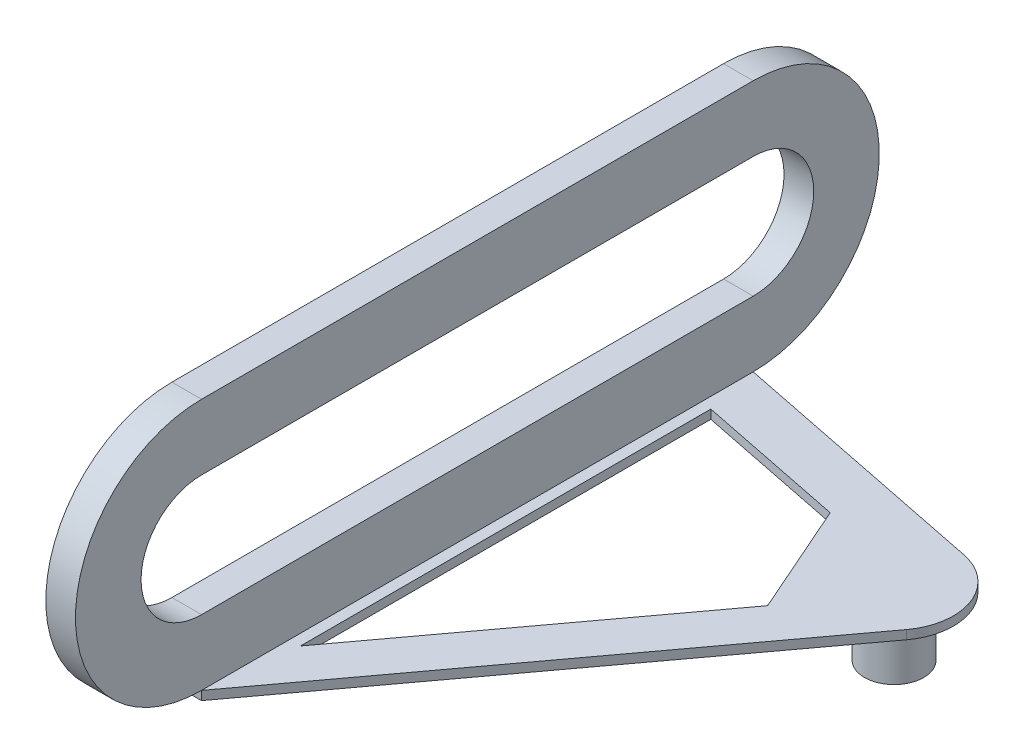
ISO-10303-21;
HEADER;
FILE_DESCRIPTION(('STEP AP214'),'2;1');
FILE_NAME('part.step','',(''),(''),'','','');
FILE_SCHEMA(('AUTOMOTIVE_DESIGN { 1 0 10303 214 1 1 1 1 }'));
ENDSEC;
DATA;
#1=APPLICATION_CONTEXT('core data for automotive mechanical design processes');
#2=APPLICATION_PROTOCOL_DEFINITION('international standard','automotive_design',2000,#1);
#3=PRODUCT_CONTEXT('',#1,'mechanical');
#4=PRODUCT('Part','Part','',(#3));
#5=PRODUCT_RELATED_PRODUCT_CATEGORY('part','',(#4));
#6=PRODUCT_DEFINITION_FORMATION('','',#4);
#7=PRODUCT_DEFINITION_CONTEXT('part definition',#1,'design');
#8=PRODUCT_DEFINITION('design','',#6,#7);
#9=PRODUCT_DEFINITION_SHAPE('','',#8);
#10=(LENGTH_UNIT() NAMED_UNIT(*) SI_UNIT(.MILLI.,.METRE.));
#11=(NAMED_UNIT(*) PLANE_ANGLE_UNIT() SI_UNIT($,.RADIAN.));
#12=(NAMED_UNIT(*) SI_UNIT($,.STERADIAN.) SOLID_ANGLE_UNIT());
#13=UNCERTAINTY_MEASURE_WITH_UNIT(LENGTH_MEASURE(1.E-05),#10,'distance_accuracy_value','');
#14=(GEOMETRIC_REPRESENTATION_CONTEXT(3) GLOBAL_UNCERTAINTY_ASSIGNED_CONTEXT((#13)) GLOBAL_UNIT_ASSIGNED_CONTEXT((#10,
#11,#12)) REPRESENTATION_CONTEXT('',''));
#15=CARTESIAN_POINT('',(0.,0.,0.));
#16=DIRECTION('',(0.,0.,1.));
#17=DIRECTION('',(1.,0.,0.));
#18=AXIS2_PLACEMENT_3D('',#15,#16,#17);
#19=CARTESIAN_POINT('',(0.,0.,0.));
#20=DIRECTION('',(1.,0.,0.));
#21=DIRECTION('',(0.,0.,-1.));
#22=AXIS2_PLACEMENT_3D('',#19,#20,#21);
#23=CYLINDRICAL_SURFACE('',#22,42.5);
#24=CARTESIAN_POINT('',(10.,0.,0.));
#25=DIRECTION('',(1.,0.,0.));
#26=DIRECTION('',(0.,0.,-1.));
#27=AXIS2_PLACEMENT_3D('',#24,#25,#26);
#28=CIRCLE('',#27,42.5);
#29=CARTESIAN_POINT('',(10.,-42.5,0.));
#30=VERTEX_POINT('',#29);
#31=CARTESIAN_POINT('',(10.,42.5,0.));
#32=VERTEX_POINT('',#31);
#33=EDGE_CURVE('E251',#30,#32,#28,.T.);
#34=ORIENTED_EDGE('',*,*,#33,.F.);
#35=DIRECTION('',(1.,0.,0.));
#36=VECTOR('',#35,1.);
#37=CARTESIAN_POINT('',(0.,-42.5,0.));
#38=LINE('',#37,#36);
#39=CARTESIAN_POINT('',(0.,-42.5,0.));
#40=VERTEX_POINT('',#39);
#41=EDGE_CURVE('E273',#40,#30,#38,.T.);
#42=ORIENTED_EDGE('',*,*,#41,.F.);
#43=CARTESIAN_POINT('',(0.,0.,0.));
#44=DIRECTION('',(1.,0.,0.));
#45=DIRECTION('',(0.,0.,-1.));
#46=AXIS2_PLACEMENT_3D('',#43,#44,#45);
#47=CIRCLE('',#46,42.5);
#48=CARTESIAN_POINT('',(0.,42.5,0.));
#49=VERTEX_POINT('',#48);
#50=EDGE_CURVE('E252',#40,#49,#47,.T.);
#51=ORIENTED_EDGE('',*,*,#50,.T.);
#52=DIRECTION('',(1.,0.,0.));
#53=VECTOR('',#52,1.);
#54=CARTESIAN_POINT('',(0.,42.5,0.));
#55=LINE('',#54,#53);
#56=EDGE_CURVE('E262',#49,#32,#55,.T.);
#57=ORIENTED_EDGE('',*,*,#56,.T.);
#58=EDGE_LOOP('',(#34,#42,#51,#57));
#59=FACE_BOUND('',#58,.T.);
#60=ADVANCED_FACE('F39',(#59),#23,.T.);
#61=CARTESIAN_POINT('',(0.,0.,186.));
#62=DIRECTION('',(1.,0.,0.));
#63=DIRECTION('',(0.,0.,-1.));
#64=AXIS2_PLACEMENT_3D('',#61,#62,#63);
#65=CYLINDRICAL_SURFACE('',#64,42.5);
#66=CARTESIAN_POINT('',(10.,0.,186.));
#67=DIRECTION('',(1.,0.,0.));
#68=DIRECTION('',(0.,0.,-1.));
#69=AXIS2_PLACEMENT_3D('',#66,#67,#68);
#70=CIRCLE('',#69,42.5);
#71=CARTESIAN_POINT('',(10.,42.5,186.));
#72=VERTEX_POINT('',#71);
#73=CARTESIAN_POINT('',(10.,-42.5,186.));
#74=VERTEX_POINT('',#73);
#75=EDGE_CURVE('E268',#72,#74,#70,.T.);
#76=ORIENTED_EDGE('',*,*,#75,.F.);
#77=DIRECTION('',(1.,0.,0.));
#78=VECTOR('',#77,1.);
#79=CARTESIAN_POINT('',(0.,42.5,186.));
#80=LINE('',#79,#78);
#81=CARTESIAN_POINT('',(0.,42.5,186.));
#82=VERTEX_POINT('',#81);
#83=EDGE_CURVE('E280',#82,#72,#80,.T.);
#84=ORIENTED_EDGE('',*,*,#83,.F.);
#85=CARTESIAN_POINT('',(0.,0.,186.));
#86=DIRECTION('',(1.,0.,0.));
#87=DIRECTION('',(0.,0.,-1.));
#88=AXIS2_PLACEMENT_3D('',#85,#86,#87);
#89=CIRCLE('',#88,42.5);
#90=CARTESIAN_POINT('',(0.,-42.5,186.));
#91=VERTEX_POINT('',#90);
#92=EDGE_CURVE('E259',#82,#91,#89,.T.);
#93=ORIENTED_EDGE('',*,*,#92,.T.);
#94=DIRECTION('',(1.,0.,0.));
#95=VECTOR('',#94,1.);
#96=CARTESIAN_POINT('',(0.,-42.5,186.));
#97=LINE('',#96,#95);
#98=EDGE_CURVE('E277',#91,#74,#97,.T.);
#99=ORIENTED_EDGE('',*,*,#98,.T.);
#100=EDGE_LOOP('',(#76,#84,#93,#99));
#101=FACE_BOUND('',#100,.T.);
#102=ADVANCED_FACE('F310',(#101),#65,.T.);
#103=CARTESIAN_POINT('',(0.,42.5,0.));
#104=DIRECTION('',(0.,1.,0.));
#105=DIRECTION('',(0.,0.,1.));
#106=AXIS2_PLACEMENT_3D('',#103,#104,#105);
#107=PLANE('',#106);
#108=DIRECTION('',(0.,0.,1.));
#109=VECTOR('',#108,1.);
#110=CARTESIAN_POINT('',(10.,42.5,0.));
#111=LINE('',#110,#109);
#112=EDGE_CURVE('E265',#32,#72,#111,.T.);
#113=ORIENTED_EDGE('',*,*,#112,.F.);
#114=ORIENTED_EDGE('',*,*,#56,.F.);
#115=DIRECTION('',(0.,0.,1.));
#116=VECTOR('',#115,1.);
#117=CARTESIAN_POINT('',(0.,42.5,0.));
#118=LINE('',#117,#116);
#119=EDGE_CURVE('E255',#49,#82,#118,.T.);
#120=ORIENTED_EDGE('',*,*,#119,.T.);
#121=ORIENTED_EDGE('',*,*,#83,.T.);
#122=EDGE_LOOP('',(#113,#114,#120,#121));
#123=FACE_BOUND('',#122,.T.);
#124=ADVANCED_FACE('F315',(#123),#107,.T.);
#125=CARTESIAN_POINT('',(0.,0.,0.));
#126=DIRECTION('',(1.,0.,0.));
#127=DIRECTION('',(0.,0.,-1.));
#128=AXIS2_PLACEMENT_3D('',#125,#126,#127);
#129=PLANE('',#128);
#130=DIRECTION('',(0.,0.,1.));
#131=VECTOR('',#130,1.);
#132=CARTESIAN_POINT('',(0.,20.3900026725424,0.));
#133=LINE('',#132,#131);
#134=CARTESIAN_POINT('',(0.,20.3900026725424,0.));
#135=VERTEX_POINT('',#134);
#136=CARTESIAN_POINT('',(0.,20.3900026725424,186.));
#137=VERTEX_POINT('',#136);
#138=EDGE_CURVE('E189',#135,#137,#133,.T.);
#139=ORIENTED_EDGE('',*,*,#138,.T.);
#140=CARTESIAN_POINT('',(0.,0.,186.));
#141=DIRECTION('',(1.,0.,0.));
#142=DIRECTION('',(0.,0.,-1.));
#143=AXIS2_PLACEMENT_3D('',#140,#141,#142);
#144=CIRCLE('',#143,20.3900026725424);
#145=CARTESIAN_POINT('',(0.,-20.3900026725424,186.));
#146=VERTEX_POINT('',#145);
#147=EDGE_CURVE('E179',#137,#146,#144,.T.);
#148=ORIENTED_EDGE('',*,*,#147,.T.);
#149=DIRECTION('',(0.,0.,-1.));
#150=VECTOR('',#149,1.);
#151=CARTESIAN_POINT('',(0.,-20.3900026725424,186.));
#152=LINE('',#151,#150);
#153=CARTESIAN_POINT('',(0.,-20.3900026725424,0.));
#154=VERTEX_POINT('',#153);
#155=EDGE_CURVE('E182',#146,#154,#152,.T.);
#156=ORIENTED_EDGE('',*,*,#155,.T.);
#157=CARTESIAN_POINT('',(0.,0.,0.));
#158=DIRECTION('',(1.,0.,0.));
#159=DIRECTION('',(0.,0.,-1.));
#160=AXIS2_PLACEMENT_3D('',#157,#158,#159);
#161=CIRCLE('',#160,20.3900026725424);
#162=EDGE_CURVE('E186',#154,#135,#161,.T.);
#163=ORIENTED_EDGE('',*,*,#162,.T.);
#164=EDGE_LOOP('',(#139,#148,#156,#163));
#165=FACE_BOUND('',#164,.T.);
#166=ORIENTED_EDGE('',*,*,#50,.F.);
#167=DIRECTION('',(0.,1.,0.));
#168=VECTOR('',#167,1.);
#169=CARTESIAN_POINT('',(0.,-45.5,0.));
#170=LINE('',#169,#168);
#171=CARTESIAN_POINT('',(0.,-45.5,0.));
#172=VERTEX_POINT('',#171);
#173=EDGE_CURVE('E240',#172,#40,#170,.T.);
#174=ORIENTED_EDGE('',*,*,#173,.F.);
#175=DIRECTION('',(0.,0.,-1.));
#176=VECTOR('',#175,1.);
#177=CARTESIAN_POINT('',(0.,-45.5,0.));
#178=LINE('',#177,#176);
#179=CARTESIAN_POINT('',(0.,-45.5,186.));
#180=VERTEX_POINT('',#179);
#181=EDGE_CURVE('E222',#180,#172,#178,.T.);
#182=ORIENTED_EDGE('',*,*,#181,.F.);
#183=DIRECTION('',(0.,1.,0.));
#184=VECTOR('',#183,1.);
#185=CARTESIAN_POINT('',(0.,-45.5,186.));
#186=LINE('',#185,#184);
#187=EDGE_CURVE('E242',#180,#91,#186,.T.);
#188=ORIENTED_EDGE('',*,*,#187,.T.);
#189=ORIENTED_EDGE('',*,*,#92,.F.);
#190=ORIENTED_EDGE('',*,*,#119,.F.);
#191=EDGE_LOOP('',(#166,#174,#182,#188,#189,#190));
#192=FACE_BOUND('',#191,.T.);
#193=ADVANCED_FACE('F337',(#165,#192),#129,.F.);
#194=CARTESIAN_POINT('',(10.,0.,0.));
#195=DIRECTION('',(1.,0.,0.));
#196=DIRECTION('',(0.,0.,-1.));
#197=AXIS2_PLACEMENT_3D('',#194,#195,#196);
#198=PLANE('',#197);
#199=CARTESIAN_POINT('',(10.,0.,186.));
#200=DIRECTION('',(1.,0.,0.));
#201=DIRECTION('',(0.,0.,-1.));
#202=AXIS2_PLACEMENT_3D('',#199,#200,#201);
#203=CIRCLE('',#202,20.3900026725424);
#204=CARTESIAN_POINT('',(10.,20.3900026725424,186.));
#205=VERTEX_POINT('',#204);
#206=CARTESIAN_POINT('',(10.,-20.3900026725424,186.));
#207=VERTEX_POINT('',#206);
#208=EDGE_CURVE('E176',#205,#207,#203,.T.);
#209=ORIENTED_EDGE('',*,*,#208,.F.);
#210=DIRECTION('',(0.,0.,1.));
#211=VECTOR('',#210,1.);
#212=CARTESIAN_POINT('',(10.,20.3900026725424,0.));
#213=LINE('',#212,#211);
#214=CARTESIAN_POINT('',(10.,20.3900026725424,0.));
#215=VERTEX_POINT('',#214);
#216=EDGE_CURVE('E183',#215,#205,#213,.T.);
#217=ORIENTED_EDGE('',*,*,#216,.F.);
#218=CARTESIAN_POINT('',(10.,0.,0.));
#219=DIRECTION('',(1.,0.,0.));
#220=DIRECTION('',(0.,0.,-1.));
#221=AXIS2_PLACEMENT_3D('',#218,#219,#220);
#222=CIRCLE('',#221,20.3900026725424);
#223=CARTESIAN_POINT('',(10.,-20.3900026725424,0.));
#224=VERTEX_POINT('',#223);
#225=EDGE_CURVE('E197',#224,#215,#222,.T.);
#226=ORIENTED_EDGE('',*,*,#225,.F.);
#227=DIRECTION('',(0.,0.,-1.));
#228=VECTOR('',#227,1.);
#229=CARTESIAN_POINT('',(10.,-20.3900026725424,186.));
#230=LINE('',#229,#228);
#231=EDGE_CURVE('E194',#207,#224,#230,.T.);
#232=ORIENTED_EDGE('',*,*,#231,.F.);
#233=EDGE_LOOP('',(#209,#217,#226,#232));
#234=FACE_BOUND('',#233,.T.);
#235=ORIENTED_EDGE('',*,*,#33,.T.);
#236=ORIENTED_EDGE('',*,*,#112,.T.);
#237=ORIENTED_EDGE('',*,*,#75,.T.);
#238=DIRECTION('',(0.,0.,-1.));
#239=VECTOR('',#238,1.);
#240=CARTESIAN_POINT('',(10.,-42.5,186.));
#241=LINE('',#240,#239);
#242=EDGE_CURVE('E256',#74,#30,#241,.T.);
#243=ORIENTED_EDGE('',*,*,#242,.T.);
#244=EDGE_LOOP('',(#235,#236,#237,#243));
#245=FACE_BOUND('',#244,.T.);
#246=ADVANCED_FACE('F323',(#234,#245),#198,.T.);
#247=CARTESIAN_POINT('',(95.,-45.5,37.5));
#248=DIRECTION('',(0.,1.,0.));
#249=DIRECTION('',(0.,0.,1.));
#250=AXIS2_PLACEMENT_3D('',#247,#248,#249);
#251=CYLINDRICAL_SURFACE('',#250,20.);
#252=CARTESIAN_POINT('',(95.,-42.5,37.5));
#253=DIRECTION('',(0.,-1.,0.));
#254=DIRECTION('',(0.,0.,1.));
#255=AXIS2_PLACEMENT_3D('',#252,#253,#254);
#256=CIRCLE('',#255,20.);
#257=CARTESIAN_POINT('',(98.9443507508866,-42.5,17.892804964657));
#258=VERTEX_POINT('',#257);
#259=CARTESIAN_POINT('',(111.077371779587,-42.5,49.3961387290563));
#260=VERTEX_POINT('',#259);
#261=EDGE_CURVE('E213',#258,#260,#256,.T.);
#262=ORIENTED_EDGE('',*,*,#261,.T.);
#263=DIRECTION('',(0.,1.,0.));
#264=VECTOR('',#263,1.);
#265=CARTESIAN_POINT('',(111.077371779587,-45.5,49.3961387290563));
#266=LINE('',#265,#264);
#267=CARTESIAN_POINT('',(111.077371779587,-45.5,49.3961387290563));
#268=VERTEX_POINT('',#267);
#269=EDGE_CURVE('E248',#268,#260,#266,.T.);
#270=ORIENTED_EDGE('',*,*,#269,.F.);
#271=CARTESIAN_POINT('',(95.,-45.5,37.5));
#272=DIRECTION('',(0.,-1.,0.));
#273=DIRECTION('',(0.,0.,1.));
#274=AXIS2_PLACEMENT_3D('',#271,#272,#273);
#275=CIRCLE('',#274,20.);
#276=CARTESIAN_POINT('',(98.9443507508866,-45.5,17.892804964657));
#277=VERTEX_POINT('',#276);
#278=EDGE_CURVE('E214',#277,#268,#275,.T.);
#279=ORIENTED_EDGE('',*,*,#278,.F.);
#280=DIRECTION('',(0.,1.,0.));
#281=VECTOR('',#280,1.);
#282=CARTESIAN_POINT('',(98.9443507508866,-45.5,17.892804964657));
#283=LINE('',#282,#281);
#284=EDGE_CURVE('E228',#277,#258,#283,.T.);
#285=ORIENTED_EDGE('',*,*,#284,.T.);
#286=EDGE_LOOP('',(#262,#270,#279,#285));
#287=FACE_BOUND('',#286,.T.);
#288=ADVANCED_FACE('F348',(#287),#251,.T.);
#289=CARTESIAN_POINT('',(10.,-45.5,186.));
#290=DIRECTION('',(-0.803868588979329,0.,-0.594806936452815));
#291=DIRECTION('',(-0.594806936452815,0.,0.803868588979329));
#292=AXIS2_PLACEMENT_3D('',#289,#290,#291);
#293=PLANE('',#292);
#294=DIRECTION('',(-0.594806936452815,0.,0.803868588979329));
#295=VECTOR('',#294,1.);
#296=CARTESIAN_POINT('',(10.,-42.5,186.));
#297=LINE('',#296,#295);
#298=EDGE_CURVE('E231',#260,#74,#297,.T.);
#299=ORIENTED_EDGE('',*,*,#298,.T.);
#300=DIRECTION('',(0.,1.,0.));
#301=VECTOR('',#300,1.);
#302=CARTESIAN_POINT('',(10.,-45.5,186.));
#303=LINE('',#302,#301);
#304=CARTESIAN_POINT('',(10.,-45.5,186.));
#305=VERTEX_POINT('',#304);
#306=EDGE_CURVE('E245',#305,#74,#303,.T.);
#307=ORIENTED_EDGE('',*,*,#306,.F.);
#308=DIRECTION('',(-0.594806936452815,0.,0.803868588979329));
#309=VECTOR('',#308,1.);
#310=CARTESIAN_POINT('',(10.,-45.5,186.));
#311=LINE('',#310,#309);
#312=EDGE_CURVE('E217',#268,#305,#311,.T.);
#313=ORIENTED_EDGE('',*,*,#312,.F.);
#314=ORIENTED_EDGE('',*,*,#269,.T.);
#315=EDGE_LOOP('',(#299,#307,#313,#314));
#316=FACE_BOUND('',#315,.T.);
#317=ADVANCED_FACE('F328',(#316),#293,.F.);
#318=CARTESIAN_POINT('',(0.,-45.5,186.));
#319=DIRECTION('',(0.,0.,-1.));
#320=DIRECTION('',(-1.,0.,0.));
#321=AXIS2_PLACEMENT_3D('',#318,#319,#320);
#322=PLANE('',#321);
#323=ORIENTED_EDGE('',*,*,#98,.F.);
#324=ORIENTED_EDGE('',*,*,#187,.F.);
#325=DIRECTION('',(-1.,0.,0.));
#326=VECTOR('',#325,1.);
#327=CARTESIAN_POINT('',(0.,-45.5,186.));
#328=LINE('',#327,#326);
#329=EDGE_CURVE('E220',#305,#180,#328,.T.);
#330=ORIENTED_EDGE('',*,*,#329,.F.);
#331=ORIENTED_EDGE('',*,*,#306,.T.);
#332=EDGE_LOOP('',(#323,#324,#330,#331));
#333=FACE_BOUND('',#332,.T.);
#334=ADVANCED_FACE('F332',(#333),#322,.F.);
#335=CARTESIAN_POINT('',(10.,-45.5,0.));
#336=DIRECTION('',(0.,0.,1.));
#337=DIRECTION('',(1.,0.,0.));
#338=AXIS2_PLACEMENT_3D('',#335,#336,#337);
#339=PLANE('',#338);
#340=ORIENTED_EDGE('',*,*,#41,.T.);
#341=DIRECTION('',(0.,1.,0.));
#342=VECTOR('',#341,1.);
#343=CARTESIAN_POINT('',(10.,-45.5,0.));
#344=LINE('',#343,#342);
#345=CARTESIAN_POINT('',(10.,-45.5,0.));
#346=VERTEX_POINT('',#345);
#347=EDGE_CURVE('E237',#346,#30,#344,.T.);
#348=ORIENTED_EDGE('',*,*,#347,.F.);
#349=DIRECTION('',(1.,0.,0.));
#350=VECTOR('',#349,1.);
#351=CARTESIAN_POINT('',(10.,-45.5,0.));
#352=LINE('',#351,#350);
#353=EDGE_CURVE('E224',#172,#346,#352,.T.);
#354=ORIENTED_EDGE('',*,*,#353,.F.);
#355=ORIENTED_EDGE('',*,*,#173,.T.);
#356=EDGE_LOOP('',(#340,#348,#354,#355));
#357=FACE_BOUND('',#356,.T.);
#358=ADVANCED_FACE('F358',(#357),#339,.F.);
#359=CARTESIAN_POINT('',(98.9443507508866,-45.5,17.892804964657));
#360=DIRECTION('',(-0.197217537544331,0.,0.980359751767151));
#361=DIRECTION('',(0.980359751767151,0.,0.197217537544331));
#362=AXIS2_PLACEMENT_3D('',#359,#360,#361);
#363=PLANE('',#362);
#364=DIRECTION('',(0.980359751767151,0.,0.197217537544331));
#365=VECTOR('',#364,1.);
#366=CARTESIAN_POINT('',(98.9443507508866,-42.5,17.892804964657));
#367=LINE('',#366,#365);
#368=EDGE_CURVE('E218',#30,#258,#367,.T.);
#369=ORIENTED_EDGE('',*,*,#368,.T.);
#370=ORIENTED_EDGE('',*,*,#284,.F.);
#371=DIRECTION('',(0.980359751767151,0.,0.197217537544331));
#372=VECTOR('',#371,1.);
#373=CARTESIAN_POINT('',(98.9443507508866,-45.5,17.892804964657));
#374=LINE('',#373,#372);
#375=EDGE_CURVE('E226',#346,#277,#374,.T.);
#376=ORIENTED_EDGE('',*,*,#375,.F.);
#377=ORIENTED_EDGE('',*,*,#347,.T.);
#378=EDGE_LOOP('',(#369,#370,#376,#377));
#379=FACE_BOUND('',#378,.T.);
#380=ADVANCED_FACE('F361',(#379),#363,.F.);
#381=CARTESIAN_POINT('',(95.,-45.5,37.5));
#382=DIRECTION('',(0.,1.,0.));
#383=DIRECTION('',(0.,0.,1.));
#384=AXIS2_PLACEMENT_3D('',#381,#382,#383);
#385=PLANE('',#384);
#386=DIRECTION('',(0.,0.,-1.));
#387=VECTOR('',#386,1.);
#388=CARTESIAN_POINT('',(13.7159350256524,-45.5,156.359237722558));
#389=LINE('',#388,#387);
#390=CARTESIAN_POINT('',(13.7159350256524,-45.5,156.359237722558));
#391=VERTEX_POINT('',#390);
#392=CARTESIAN_POINT('',(13.7159350256524,-45.5,18.0160142694245));
#393=VERTEX_POINT('',#392);
#394=EDGE_CURVE('E162',#391,#393,#389,.T.);
#395=ORIENTED_EDGE('',*,*,#394,.F.);
#396=DIRECTION('',(-0.594806936452815,0.,0.803868588979329));
#397=VECTOR('',#396,1.);
#398=CARTESIAN_POINT('',(80.693023557422,-45.5,65.8411647944554));
#399=LINE('',#398,#397);
#400=CARTESIAN_POINT('',(80.693023557422,-45.5,65.8411647944554));
#401=VERTEX_POINT('',#400);
#402=EDGE_CURVE('E53',#401,#391,#399,.T.);
#403=ORIENTED_EDGE('',*,*,#402,.F.);
#404=DIRECTION('',(0.402880786195544,0.,0.915252463593767));
#405=VECTOR('',#404,1.);
#406=CARTESIAN_POINT('',(64.1029317293349,-45.5,28.1522927082754));
#407=LINE('',#406,#405);
#408=CARTESIAN_POINT('',(64.1029317293349,-45.5,28.1522927082754));
#409=VERTEX_POINT('',#408);
#410=EDGE_CURVE('E169',#409,#401,#407,.T.);
#411=ORIENTED_EDGE('',*,*,#410,.F.);
#412=DIRECTION('',(0.980359751767151,0.,0.197217537544331));
#413=VECTOR('',#412,1.);
#414=CARTESIAN_POINT('',(13.7159350256524,-45.5,18.0160142694245));
#415=LINE('',#414,#413);
#416=EDGE_CURVE('E153',#393,#409,#415,.T.);
#417=ORIENTED_EDGE('',*,*,#416,.F.);
#418=EDGE_LOOP('',(#395,#403,#411,#417));
#419=FACE_BOUND('',#418,.T.);
#420=CARTESIAN_POINT('',(95.,-45.5,37.5));
#421=DIRECTION('',(0.,1.,0.));
#422=DIRECTION('',(0.,0.,1.));
#423=AXIS2_PLACEMENT_3D('',#420,#421,#422);
#424=CIRCLE('',#423,9.99999999999999);
#425=CARTESIAN_POINT('',(95.,-45.5,47.5));
#426=VERTEX_POINT('',#425);
#427=EDGE_CURVE('E276',#426,#426,#424,.F.);
#428=ORIENTED_EDGE('',*,*,#427,.F.);
#429=EDGE_LOOP('',(#428));
#430=FACE_BOUND('',#429,.T.);
#431=ORIENTED_EDGE('',*,*,#278,.T.);
#432=ORIENTED_EDGE('',*,*,#312,.T.);
#433=ORIENTED_EDGE('',*,*,#329,.T.);
#434=ORIENTED_EDGE('',*,*,#181,.T.);
#435=ORIENTED_EDGE('',*,*,#353,.T.);
#436=ORIENTED_EDGE('',*,*,#375,.T.);
#437=EDGE_LOOP('',(#431,#432,#433,#434,#435,#436));
#438=FACE_BOUND('',#437,.T.);
#439=ADVANCED_FACE('F166',(#419,#430,#438),#385,.F.);
#440=CARTESIAN_POINT('',(95.,-42.5,37.5));
#441=DIRECTION('',(0.,1.,0.));
#442=DIRECTION('',(0.,0.,1.));
#443=AXIS2_PLACEMENT_3D('',#440,#441,#442);
#444=PLANE('',#443);
#445=DIRECTION('',(0.594806936452815,0.,-0.803868588979329));
#446=VECTOR('',#445,1.);
#447=CARTESIAN_POINT('',(99.3059964076367,-42.5,40.6861383399184));
#448=LINE('',#447,#446);
#449=CARTESIAN_POINT('',(13.7159350256524,-42.5,156.359237722558));
#450=VERTEX_POINT('',#449);
#451=CARTESIAN_POINT('',(80.693023557422,-42.5,65.8411647944554));
#452=VERTEX_POINT('',#451);
#453=EDGE_CURVE('E11',#450,#452,#448,.T.);
#454=ORIENTED_EDGE('',*,*,#453,.F.);
#455=DIRECTION('',(0.,0.,1.));
#456=VECTOR('',#455,1.);
#457=CARTESIAN_POINT('',(13.7159350256524,-42.5,37.5));
#458=LINE('',#457,#456);
#459=CARTESIAN_POINT('',(13.7159350256524,-42.5,18.0160142694245));
#460=VERTEX_POINT('',#459);
#461=EDGE_CURVE('E285',#460,#450,#458,.T.);
#462=ORIENTED_EDGE('',*,*,#461,.F.);
#463=DIRECTION('',(-0.980359751767151,0.,-0.197217537544331));
#464=VECTOR('',#463,1.);
#465=CARTESIAN_POINT('',(95.6055904253571,-42.5,34.4896364873626));
#466=LINE('',#465,#464);
#467=CARTESIAN_POINT('',(64.1029317293349,-42.5,28.1522927082754));
#468=VERTEX_POINT('',#467);
#469=EDGE_CURVE('E156',#468,#460,#466,.T.);
#470=ORIENTED_EDGE('',*,*,#469,.F.);
#471=DIRECTION('',(-0.402880786195544,0.,-0.915252463593767));
#472=VECTOR('',#471,1.);
#473=CARTESIAN_POINT('',(72.564776795741,-42.5,47.3756580534223));
#474=LINE('',#473,#472);
#475=EDGE_CURVE('E46',#452,#468,#474,.T.);
#476=ORIENTED_EDGE('',*,*,#475,.F.);
#477=EDGE_LOOP('',(#454,#462,#470,#476));
#478=FACE_BOUND('',#477,.T.);
#479=ORIENTED_EDGE('',*,*,#368,.F.);
#480=ORIENTED_EDGE('',*,*,#242,.F.);
#481=ORIENTED_EDGE('',*,*,#298,.F.);
#482=ORIENTED_EDGE('',*,*,#261,.F.);
#483=EDGE_LOOP('',(#479,#480,#481,#482));
#484=FACE_BOUND('',#483,.T.);
#485=ADVANCED_FACE('F293',(#478,#484),#444,.T.);
#486=CARTESIAN_POINT('',(95.,-65.5,37.5));
#487=DIRECTION('',(0.,1.,0.));
#488=DIRECTION('',(0.,0.,1.));
#489=AXIS2_PLACEMENT_3D('',#486,#487,#488);
#490=CYLINDRICAL_SURFACE('',#489,9.99999999999999);
#491=CARTESIAN_POINT('',(95.,-65.5,37.5));
#492=DIRECTION('',(0.,-1.,0.));
#493=DIRECTION('',(0.,0.,-1.));
#494=AXIS2_PLACEMENT_3D('',#491,#492,#493);
#495=CIRCLE('',#494,9.99999999999999);
#496=CARTESIAN_POINT('',(95.,-65.5,27.5));
#497=VERTEX_POINT('',#496);
#498=EDGE_CURVE('E204',#497,#497,#495,.T.);
#499=ORIENTED_EDGE('',*,*,#498,.F.);
#500=EDGE_LOOP('',(#499));
#501=FACE_BOUND('',#500,.T.);
#502=ORIENTED_EDGE('',*,*,#427,.T.);
#503=EDGE_LOOP('',(#502));
#504=FACE_BOUND('',#503,.T.);
#505=ADVANCED_FACE('F368',(#501,#504),#490,.T.);
#506=CARTESIAN_POINT('',(95.,-65.5,37.5));
#507=DIRECTION('',(0.,-1.,0.));
#508=DIRECTION('',(0.,0.,-1.));
#509=AXIS2_PLACEMENT_3D('',#506,#507,#508);
#510=PLANE('',#509);
#511=ORIENTED_EDGE('',*,*,#498,.T.);
#512=EDGE_LOOP('',(#511));
#513=FACE_BOUND('',#512,.T.);
#514=ADVANCED_FACE('F373',(#513),#510,.T.);
#515=CARTESIAN_POINT('',(0.,0.,186.));
#516=DIRECTION('',(1.,0.,0.));
#517=DIRECTION('',(0.,0.,-1.));
#518=AXIS2_PLACEMENT_3D('',#515,#516,#517);
#519=CYLINDRICAL_SURFACE('',#518,20.3900026725424);
#520=ORIENTED_EDGE('',*,*,#208,.T.);
#521=DIRECTION('',(1.,0.,0.));
#522=VECTOR('',#521,1.);
#523=CARTESIAN_POINT('',(0.,-20.3900026725424,186.));
#524=LINE('',#523,#522);
#525=EDGE_CURVE('E192',#146,#207,#524,.T.);
#526=ORIENTED_EDGE('',*,*,#525,.F.);
#527=ORIENTED_EDGE('',*,*,#147,.F.);
#528=DIRECTION('',(1.,0.,0.));
#529=VECTOR('',#528,1.);
#530=CARTESIAN_POINT('',(0.,20.3900026725424,186.));
#531=LINE('',#530,#529);
#532=EDGE_CURVE('E202',#137,#205,#531,.T.);
#533=ORIENTED_EDGE('',*,*,#532,.T.);
#534=EDGE_LOOP('',(#520,#526,#527,#533));
#535=FACE_BOUND('',#534,.T.);
#536=ADVANCED_FACE('F377',(#535),#519,.F.);
#537=CARTESIAN_POINT('',(0.,20.3900026725424,0.));
#538=DIRECTION('',(0.,1.,0.));
#539=DIRECTION('',(0.,0.,1.));
#540=AXIS2_PLACEMENT_3D('',#537,#538,#539);
#541=PLANE('',#540);
#542=ORIENTED_EDGE('',*,*,#216,.T.);
#543=ORIENTED_EDGE('',*,*,#532,.F.);
#544=ORIENTED_EDGE('',*,*,#138,.F.);
#545=DIRECTION('',(1.,0.,0.));
#546=VECTOR('',#545,1.);
#547=CARTESIAN_POINT('',(0.,20.3900026725424,0.));
#548=LINE('',#547,#546);
#549=EDGE_CURVE('E205',#135,#215,#548,.T.);
#550=ORIENTED_EDGE('',*,*,#549,.T.);
#551=EDGE_LOOP('',(#542,#543,#544,#550));
#552=FACE_BOUND('',#551,.T.);
#553=ADVANCED_FACE('F380',(#552),#541,.F.);
#554=CARTESIAN_POINT('',(0.,0.,0.));
#555=DIRECTION('',(1.,0.,0.));
#556=DIRECTION('',(0.,0.,-1.));
#557=AXIS2_PLACEMENT_3D('',#554,#555,#556);
#558=CYLINDRICAL_SURFACE('',#557,20.3900026725424);
#559=ORIENTED_EDGE('',*,*,#225,.T.);
#560=ORIENTED_EDGE('',*,*,#549,.F.);
#561=ORIENTED_EDGE('',*,*,#162,.F.);
#562=DIRECTION('',(1.,0.,0.));
#563=VECTOR('',#562,1.);
#564=CARTESIAN_POINT('',(0.,-20.3900026725424,0.));
#565=LINE('',#564,#563);
#566=EDGE_CURVE('E207',#154,#224,#565,.T.);
#567=ORIENTED_EDGE('',*,*,#566,.T.);
#568=EDGE_LOOP('',(#559,#560,#561,#567));
#569=FACE_BOUND('',#568,.T.);
#570=ADVANCED_FACE('F304',(#569),#558,.F.);
#571=CARTESIAN_POINT('',(0.,-20.3900026725424,186.));
#572=DIRECTION('',(0.,-1.,0.));
#573=DIRECTION('',(0.,0.,-1.));
#574=AXIS2_PLACEMENT_3D('',#571,#572,#573);
#575=PLANE('',#574);
#576=ORIENTED_EDGE('',*,*,#231,.T.);
#577=ORIENTED_EDGE('',*,*,#566,.F.);
#578=ORIENTED_EDGE('',*,*,#155,.F.);
#579=ORIENTED_EDGE('',*,*,#525,.T.);
#580=EDGE_LOOP('',(#576,#577,#578,#579));
#581=FACE_BOUND('',#580,.T.);
#582=ADVANCED_FACE('F297',(#581),#575,.F.);
#583=CARTESIAN_POINT('',(80.693023557422,42.5,65.8411647944554));
#584=DIRECTION('',(0.803868588979329,0.,0.594806936452815));
#585=DIRECTION('',(0.594806936452815,0.,-0.803868588979329));
#586=AXIS2_PLACEMENT_3D('',#583,#584,#585);
#587=PLANE('',#586);
#588=ORIENTED_EDGE('',*,*,#453,.T.);
#589=DIRECTION('',(0.,-1.,0.));
#590=VECTOR('',#589,1.);
#591=CARTESIAN_POINT('',(80.693023557422,42.5,65.8411647944554));
#592=LINE('',#591,#590);
#593=EDGE_CURVE('E174',#452,#401,#592,.T.);
#594=ORIENTED_EDGE('',*,*,#593,.T.);
#595=ORIENTED_EDGE('',*,*,#402,.T.);
#596=DIRECTION('',(0.,-1.,0.));
#597=VECTOR('',#596,1.);
#598=CARTESIAN_POINT('',(13.7159350256524,42.5,156.359237722558));
#599=LINE('',#598,#597);
#600=EDGE_CURVE('E159',#450,#391,#599,.T.);
#601=ORIENTED_EDGE('',*,*,#600,.F.);
#602=EDGE_LOOP('',(#588,#594,#595,#601));
#603=FACE_BOUND('',#602,.T.);
#604=ADVANCED_FACE('F295',(#603),#587,.F.);
#605=CARTESIAN_POINT('',(64.1029317293349,42.5,28.1522927082754));
#606=DIRECTION('',(0.915252463593767,0.,-0.402880786195544));
#607=DIRECTION('',(-0.402880786195544,0.,-0.915252463593767));
#608=AXIS2_PLACEMENT_3D('',#605,#606,#607);
#609=PLANE('',#608);
#610=ORIENTED_EDGE('',*,*,#475,.T.);
#611=DIRECTION('',(0.,-1.,0.));
#612=VECTOR('',#611,1.);
#613=CARTESIAN_POINT('',(64.1029317293349,42.5,28.1522927082754));
#614=LINE('',#613,#612);
#615=EDGE_CURVE('E158',#468,#409,#614,.T.);
#616=ORIENTED_EDGE('',*,*,#615,.T.);
#617=ORIENTED_EDGE('',*,*,#410,.T.);
#618=ORIENTED_EDGE('',*,*,#593,.F.);
#619=EDGE_LOOP('',(#610,#616,#617,#618));
#620=FACE_BOUND('',#619,.T.);
#621=ADVANCED_FACE('F290',(#620),#609,.F.);
#622=CARTESIAN_POINT('',(13.7159350256524,42.5,18.0160142694245));
#623=DIRECTION('',(0.197217537544331,0.,-0.980359751767151));
#624=DIRECTION('',(-0.980359751767151,0.,-0.197217537544331));
#625=AXIS2_PLACEMENT_3D('',#622,#623,#624);
#626=PLANE('',#625);
#627=ORIENTED_EDGE('',*,*,#469,.T.);
#628=DIRECTION('',(0.,-1.,0.));
#629=VECTOR('',#628,1.);
#630=CARTESIAN_POINT('',(13.7159350256524,42.5,18.0160142694245));
#631=LINE('',#630,#629);
#632=EDGE_CURVE('E61',#460,#393,#631,.T.);
#633=ORIENTED_EDGE('',*,*,#632,.T.);
#634=ORIENTED_EDGE('',*,*,#416,.T.);
#635=ORIENTED_EDGE('',*,*,#615,.F.);
#636=EDGE_LOOP('',(#627,#633,#634,#635));
#637=FACE_BOUND('',#636,.T.);
#638=ADVANCED_FACE('F150',(#637),#626,.F.);
#639=CARTESIAN_POINT('',(13.7159350256524,42.5,156.359237722558));
#640=DIRECTION('',(-1.,0.,0.));
#641=DIRECTION('',(0.,0.,1.));
#642=AXIS2_PLACEMENT_3D('',#639,#640,#641);
#643=PLANE('',#642);
#644=ORIENTED_EDGE('',*,*,#461,.T.);
#645=ORIENTED_EDGE('',*,*,#600,.T.);
#646=ORIENTED_EDGE('',*,*,#394,.T.);
#647=ORIENTED_EDGE('',*,*,#632,.F.);
#648=EDGE_LOOP('',(#644,#645,#646,#647));
#649=FACE_BOUND('',#648,.T.);
#650=ADVANCED_FACE('F163',(#649),#643,.F.);
#651=CLOSED_SHELL('',(#60,#102,#124,#193,#246,#288,#317,#334,#358,#380,#439,#485,#505,#514,#536,
#553,#570,#582,#604,#621,#638,#650));
#652=MANIFOLD_SOLID_BREP('B2',#651);
#653=ADVANCED_BREP_SHAPE_REPRESENTATION('',(#18,#652),#14);
#654=SHAPE_DEFINITION_REPRESENTATION(#9,#653);
ENDSEC;
END-ISO-10303-21;
